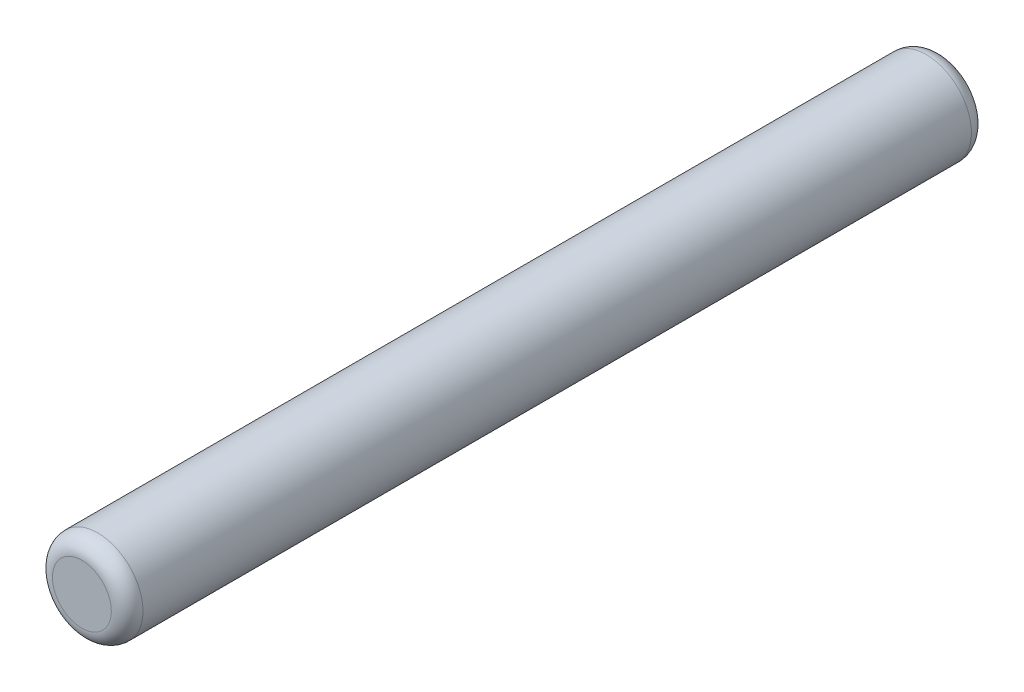
ISO-10303-21;
HEADER;
FILE_DESCRIPTION(('STEP AP214'),'2;1');
FILE_NAME('part.step','',(''),(''),'','','');
FILE_SCHEMA(('AUTOMOTIVE_DESIGN { 1 0 10303 214 1 1 1 1 }'));
ENDSEC;
DATA;
#1=APPLICATION_CONTEXT('core data for automotive mechanical design processes');
#2=APPLICATION_PROTOCOL_DEFINITION('international standard','automotive_design',2000,#1);
#3=PRODUCT_CONTEXT('',#1,'mechanical');
#4=PRODUCT('Part','Part','',(#3));
#5=PRODUCT_RELATED_PRODUCT_CATEGORY('part','',(#4));
#6=PRODUCT_DEFINITION_FORMATION('','',#4);
#7=PRODUCT_DEFINITION_CONTEXT('part definition',#1,'design');
#8=PRODUCT_DEFINITION('design','',#6,#7);
#9=PRODUCT_DEFINITION_SHAPE('','',#8);
#10=(LENGTH_UNIT() NAMED_UNIT(*) SI_UNIT(.MILLI.,.METRE.));
#11=(NAMED_UNIT(*) PLANE_ANGLE_UNIT() SI_UNIT($,.RADIAN.));
#12=(NAMED_UNIT(*) SI_UNIT($,.STERADIAN.) SOLID_ANGLE_UNIT());
#13=UNCERTAINTY_MEASURE_WITH_UNIT(LENGTH_MEASURE(1.E-05),#10,'distance_accuracy_value','');
#14=(GEOMETRIC_REPRESENTATION_CONTEXT(3) GLOBAL_UNCERTAINTY_ASSIGNED_CONTEXT((#13)) GLOBAL_UNIT_ASSIGNED_CONTEXT((#10,
#11,#12)) REPRESENTATION_CONTEXT('',''));
#15=CARTESIAN_POINT('',(0.,0.,0.));
#16=DIRECTION('',(0.,0.,1.));
#17=DIRECTION('',(1.,0.,0.));
#18=AXIS2_PLACEMENT_3D('',#15,#16,#17);
#19=CARTESIAN_POINT('',(0.,0.,9.5));
#20=DIRECTION('',(0.,0.,-1.));
#21=DIRECTION('',(-1.,0.,0.));
#22=AXIS2_PLACEMENT_3D('',#19,#20,#21);
#23=CYLINDRICAL_SURFACE('',#22,1.);
#24=CARTESIAN_POINT('',(0.,0.,-9.15));
#25=DIRECTION('',(0.,0.,1.));
#26=DIRECTION('',(1.,0.,0.));
#27=AXIS2_PLACEMENT_3D('',#24,#25,#26);
#28=CIRCLE('',#27,1.);
#29=CARTESIAN_POINT('',(1.,0.,-9.15));
#30=VERTEX_POINT('',#29);
#31=EDGE_CURVE('E42',#30,#30,#28,.T.);
#32=ORIENTED_EDGE('',*,*,#31,.T.);
#33=EDGE_LOOP('',(#32));
#34=FACE_BOUND('',#33,.T.);
#35=CARTESIAN_POINT('',(0.,0.,9.15));
#36=DIRECTION('',(0.,0.,1.));
#37=DIRECTION('',(1.,0.,0.));
#38=AXIS2_PLACEMENT_3D('',#35,#36,#37);
#39=CIRCLE('',#38,1.);
#40=CARTESIAN_POINT('',(1.,0.,9.15));
#41=VERTEX_POINT('',#40);
#42=EDGE_CURVE('E46',#41,#41,#39,.F.);
#43=ORIENTED_EDGE('',*,*,#42,.T.);
#44=EDGE_LOOP('',(#43));
#45=FACE_BOUND('',#44,.T.);
#46=ADVANCED_FACE('F31',(#34,#45),#23,.T.);
#47=CARTESIAN_POINT('',(0.,0.,9.5));
#48=DIRECTION('',(0.,0.,1.));
#49=DIRECTION('',(1.,0.,0.));
#50=AXIS2_PLACEMENT_3D('',#47,#48,#49);
#51=PLANE('',#50);
#52=CARTESIAN_POINT('',(0.,0.,9.5));
#53=DIRECTION('',(0.,0.,1.));
#54=DIRECTION('',(1.,0.,0.));
#55=AXIS2_PLACEMENT_3D('',#52,#53,#54);
#56=CIRCLE('',#55,0.65);
#57=CARTESIAN_POINT('',(0.65,0.,9.5));
#58=VERTEX_POINT('',#57);
#59=EDGE_CURVE('E10',#58,#58,#56,.T.);
#60=ORIENTED_EDGE('',*,*,#59,.T.);
#61=EDGE_LOOP('',(#60));
#62=FACE_BOUND('',#61,.T.);
#63=ADVANCED_FACE('F62',(#62),#51,.T.);
#64=CARTESIAN_POINT('',(0.,0.,-9.5));
#65=DIRECTION('',(0.,0.,1.));
#66=DIRECTION('',(1.,0.,0.));
#67=AXIS2_PLACEMENT_3D('',#64,#65,#66);
#68=PLANE('',#67);
#69=CARTESIAN_POINT('',(0.,0.,-9.5));
#70=DIRECTION('',(0.,0.,1.));
#71=DIRECTION('',(1.,0.,0.));
#72=AXIS2_PLACEMENT_3D('',#69,#70,#71);
#73=CIRCLE('',#72,0.65);
#74=CARTESIAN_POINT('',(0.65,0.,-9.5));
#75=VERTEX_POINT('',#74);
#76=EDGE_CURVE('E38',#75,#75,#73,.F.);
#77=ORIENTED_EDGE('',*,*,#76,.T.);
#78=EDGE_LOOP('',(#77));
#79=FACE_BOUND('',#78,.T.);
#80=ADVANCED_FACE('F59',(#79),#68,.F.);
#81=CARTESIAN_POINT('',(0.,0.,-9.15));
#82=DIRECTION('',(0.,0.,1.));
#83=DIRECTION('',(1.,0.,0.));
#84=AXIS2_PLACEMENT_3D('',#81,#82,#83);
#85=TOROIDAL_SURFACE('',#84,0.65,0.35);
#86=ORIENTED_EDGE('',*,*,#76,.F.);
#87=EDGE_LOOP('',(#86));
#88=FACE_BOUND('',#87,.T.);
#89=ORIENTED_EDGE('',*,*,#31,.F.);
#90=EDGE_LOOP('',(#89));
#91=FACE_BOUND('',#90,.T.);
#92=ADVANCED_FACE('F55',(#88,#91),#85,.T.);
#93=CARTESIAN_POINT('',(0.,0.,9.15));
#94=DIRECTION('',(0.,0.,1.));
#95=DIRECTION('',(1.,0.,0.));
#96=AXIS2_PLACEMENT_3D('',#93,#94,#95);
#97=TOROIDAL_SURFACE('',#96,0.65,0.35);
#98=ORIENTED_EDGE('',*,*,#42,.F.);
#99=EDGE_LOOP('',(#98));
#100=FACE_BOUND('',#99,.T.);
#101=ORIENTED_EDGE('',*,*,#59,.F.);
#102=EDGE_LOOP('',(#101));
#103=FACE_BOUND('',#102,.T.);
#104=ADVANCED_FACE('F33',(#100,#103),#97,.T.);
#105=CLOSED_SHELL('',(#46,#63,#80,#92,#104));
#106=MANIFOLD_SOLID_BREP('B2',#105);
#107=ADVANCED_BREP_SHAPE_REPRESENTATION('',(#18,#106),#14);
#108=SHAPE_DEFINITION_REPRESENTATION(#9,#107);
ENDSEC;
END-ISO-10303-21;
